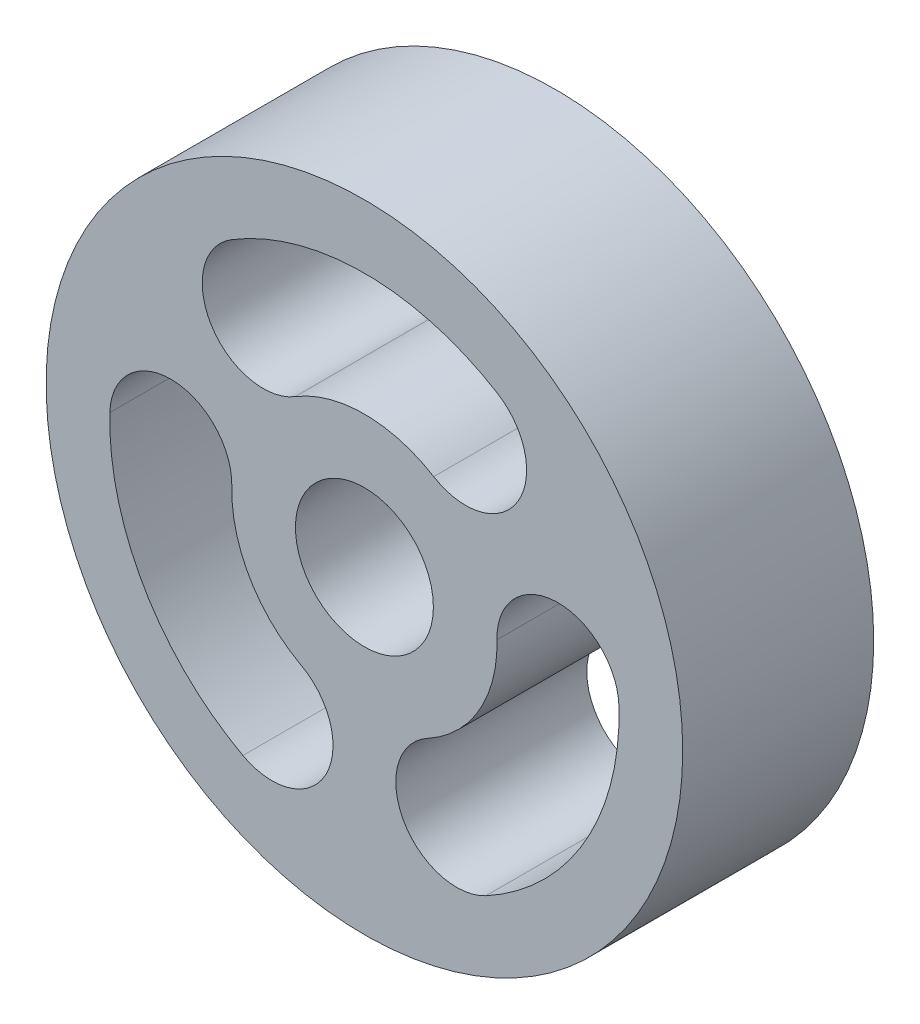
ISO-10303-21;
HEADER;
FILE_DESCRIPTION(('STEP AP214'),'2;1');
FILE_NAME('part.step','',(''),(''),'','','');
FILE_SCHEMA(('AUTOMOTIVE_DESIGN { 1 0 10303 214 1 1 1 1 }'));
ENDSEC;
DATA;
#1=APPLICATION_CONTEXT('core data for automotive mechanical design processes');
#2=APPLICATION_PROTOCOL_DEFINITION('international standard','automotive_design',2000,#1);
#3=PRODUCT_CONTEXT('',#1,'mechanical');
#4=PRODUCT('Part','Part','',(#3));
#5=PRODUCT_RELATED_PRODUCT_CATEGORY('part','',(#4));
#6=PRODUCT_DEFINITION_FORMATION('','',#4);
#7=PRODUCT_DEFINITION_CONTEXT('part definition',#1,'design');
#8=PRODUCT_DEFINITION('design','',#6,#7);
#9=PRODUCT_DEFINITION_SHAPE('','',#8);
#10=(LENGTH_UNIT() NAMED_UNIT(*) SI_UNIT(.MILLI.,.METRE.));
#11=(NAMED_UNIT(*) PLANE_ANGLE_UNIT() SI_UNIT($,.RADIAN.));
#12=(NAMED_UNIT(*) SI_UNIT($,.STERADIAN.) SOLID_ANGLE_UNIT());
#13=UNCERTAINTY_MEASURE_WITH_UNIT(LENGTH_MEASURE(1.E-05),#10,'distance_accuracy_value','');
#14=(GEOMETRIC_REPRESENTATION_CONTEXT(3) GLOBAL_UNCERTAINTY_ASSIGNED_CONTEXT((#13)) GLOBAL_UNIT_ASSIGNED_CONTEXT((#10,
#11,#12)) REPRESENTATION_CONTEXT('',''));
#15=CARTESIAN_POINT('',(0.,0.,0.));
#16=DIRECTION('',(0.,0.,1.));
#17=DIRECTION('',(1.,0.,0.));
#18=AXIS2_PLACEMENT_3D('',#15,#16,#17);
#19=CARTESIAN_POINT('',(0.,0.,9.));
#20=DIRECTION('',(0.,0.,1.));
#21=DIRECTION('',(1.,0.,0.));
#22=AXIS2_PLACEMENT_3D('',#19,#20,#21);
#23=PLANE('',#22);
#24=CARTESIAN_POINT('',(0.,0.,9.));
#25=DIRECTION('',(0.,0.,1.));
#26=DIRECTION('',(1.,0.,0.));
#27=AXIS2_PLACEMENT_3D('',#24,#25,#26);
#28=CIRCLE('',#27,15.);
#29=CARTESIAN_POINT('',(15.,0.,9.));
#30=VERTEX_POINT('',#29);
#31=EDGE_CURVE('E11',#30,#30,#28,.T.);
#32=ORIENTED_EDGE('',*,*,#31,.T.);
#33=EDGE_LOOP('',(#32));
#34=FACE_BOUND('',#33,.T.);
#35=CARTESIAN_POINT('',(0.,0.,9.));
#36=DIRECTION('',(0.,0.,1.));
#37=DIRECTION('',(1.,0.,0.));
#38=AXIS2_PLACEMENT_3D('',#35,#36,#37);
#39=CIRCLE('',#38,3.25);
#40=CARTESIAN_POINT('',(3.25,0.,9.));
#41=VERTEX_POINT('',#40);
#42=EDGE_CURVE('E222',#41,#41,#39,.T.);
#43=ORIENTED_EDGE('',*,*,#42,.F.);
#44=EDGE_LOOP('',(#43));
#45=FACE_BOUND('',#44,.T.);
#46=CARTESIAN_POINT('',(0.,0.,9.));
#47=DIRECTION('',(0.,0.,1.));
#48=DIRECTION('',(1.,0.,0.));
#49=AXIS2_PLACEMENT_3D('',#46,#47,#48);
#50=CIRCLE('',#49,12.);
#51=CARTESIAN_POINT('',(6.26998277659137,10.2316819722491,9.));
#52=VERTEX_POINT('',#51);
#53=CARTESIAN_POINT('',(-6.26998277659136,10.2316819722491,9.));
#54=VERTEX_POINT('',#53);
#55=EDGE_CURVE('E193',#52,#54,#50,.T.);
#56=ORIENTED_EDGE('',*,*,#55,.F.);
#57=CARTESIAN_POINT('',(4.76779940303302,7.7803414997311,9.));
#58=DIRECTION('',(0.,0.,1.));
#59=DIRECTION('',(1.,0.,0.));
#60=AXIS2_PLACEMENT_3D('',#57,#58,#59);
#61=CIRCLE('',#60,2.875);
#62=CARTESIAN_POINT('',(3.26561602947467,5.32900102721308,9.));
#63=VERTEX_POINT('',#62);
#64=EDGE_CURVE('E191',#63,#52,#61,.T.);
#65=ORIENTED_EDGE('',*,*,#64,.F.);
#66=CARTESIAN_POINT('',(0.,0.,9.));
#67=DIRECTION('',(0.,0.,-1.));
#68=DIRECTION('',(1.,0.,0.));
#69=AXIS2_PLACEMENT_3D('',#66,#67,#68);
#70=CIRCLE('',#69,6.25);
#71=CARTESIAN_POINT('',(-3.26561602947467,5.32900102721308,9.));
#72=VERTEX_POINT('',#71);
#73=EDGE_CURVE('E199',#72,#63,#70,.T.);
#74=ORIENTED_EDGE('',*,*,#73,.F.);
#75=CARTESIAN_POINT('',(-4.76779940303302,7.7803414997311,9.));
#76=DIRECTION('',(0.,0.,1.));
#77=DIRECTION('',(1.,0.,0.));
#78=AXIS2_PLACEMENT_3D('',#75,#76,#77);
#79=CIRCLE('',#78,2.875);
#80=EDGE_CURVE('E196',#54,#72,#79,.T.);
#81=ORIENTED_EDGE('',*,*,#80,.F.);
#82=EDGE_LOOP('',(#56,#65,#74,#81));
#83=FACE_BOUND('',#82,.T.);
#84=CARTESIAN_POINT('',(0.,0.,9.));
#85=DIRECTION('',(0.,0.,1.));
#86=DIRECTION('',(1.,0.,0.));
#87=AXIS2_PLACEMENT_3D('',#84,#85,#86);
#88=CIRCLE('',#87,12.);
#89=CARTESIAN_POINT('',(5.72590512311533,-10.5458053519436,9.));
#90=VERTEX_POINT('',#89);
#91=CARTESIAN_POINT('',(11.9958878997067,0.314123379694448,9.));
#92=VERTEX_POINT('',#91);
#93=EDGE_CURVE('E162',#90,#92,#88,.T.);
#94=ORIENTED_EDGE('',*,*,#93,.F.);
#95=CARTESIAN_POINT('',(4.35407368736895,-8.01920615304042,9.));
#96=DIRECTION('',(0.,0.,1.));
#97=DIRECTION('',(1.,0.,0.));
#98=AXIS2_PLACEMENT_3D('',#95,#96,#97);
#99=CIRCLE('',#98,2.875);
#100=CARTESIAN_POINT('',(2.98224225162257,-5.49260695413728,9.));
#101=VERTEX_POINT('',#100);
#102=EDGE_CURVE('E160',#101,#90,#99,.T.);
#103=ORIENTED_EDGE('',*,*,#102,.F.);
#104=CARTESIAN_POINT('',(0.,0.,9.));
#105=DIRECTION('',(0.,0.,-1.));
#106=DIRECTION('',(1.,0.,0.));
#107=AXIS2_PLACEMENT_3D('',#104,#105,#106);
#108=CIRCLE('',#107,6.25);
#109=CARTESIAN_POINT('',(6.24785828109723,0.163605926924194,9.));
#110=VERTEX_POINT('',#109);
#111=EDGE_CURVE('E168',#110,#101,#108,.T.);
#112=ORIENTED_EDGE('',*,*,#111,.F.);
#113=CARTESIAN_POINT('',(9.12187309040196,0.238864653309323,9.));
#114=DIRECTION('',(0.,0.,1.));
#115=DIRECTION('',(1.,0.,0.));
#116=AXIS2_PLACEMENT_3D('',#113,#114,#115);
#117=CIRCLE('',#116,2.875);
#118=EDGE_CURVE('E165',#92,#110,#117,.T.);
#119=ORIENTED_EDGE('',*,*,#118,.F.);
#120=EDGE_LOOP('',(#94,#103,#112,#119));
#121=FACE_BOUND('',#120,.T.);
#122=CARTESIAN_POINT('',(0.,0.,9.));
#123=DIRECTION('',(0.,0.,1.));
#124=DIRECTION('',(1.,0.,0.));
#125=AXIS2_PLACEMENT_3D('',#122,#123,#124);
#126=CIRCLE('',#125,12.);
#127=CARTESIAN_POINT('',(-11.9958878997067,0.314123379694449,9.));
#128=VERTEX_POINT('',#127);
#129=CARTESIAN_POINT('',(-5.72590512311533,-10.5458053519436,9.));
#130=VERTEX_POINT('',#129);
#131=EDGE_CURVE('E132',#128,#130,#126,.T.);
#132=ORIENTED_EDGE('',*,*,#131,.F.);
#133=CARTESIAN_POINT('',(-9.12187309040196,0.238864653309319,9.));
#134=DIRECTION('',(0.,0.,1.));
#135=DIRECTION('',(1.,0.,0.));
#136=AXIS2_PLACEMENT_3D('',#133,#134,#135);
#137=CIRCLE('',#136,2.875);
#138=CARTESIAN_POINT('',(-6.24785828109723,0.163605926924192,9.));
#139=VERTEX_POINT('',#138);
#140=EDGE_CURVE('E124',#139,#128,#137,.T.);
#141=ORIENTED_EDGE('',*,*,#140,.F.);
#142=CARTESIAN_POINT('',(0.,0.,9.));
#143=DIRECTION('',(0.,0.,-1.));
#144=DIRECTION('',(1.,0.,0.));
#145=AXIS2_PLACEMENT_3D('',#142,#143,#144);
#146=CIRCLE('',#145,6.25);
#147=CARTESIAN_POINT('',(-2.98224225162256,-5.49260695413728,9.));
#148=VERTEX_POINT('',#147);
#149=EDGE_CURVE('E146',#148,#139,#146,.T.);
#150=ORIENTED_EDGE('',*,*,#149,.F.);
#151=CARTESIAN_POINT('',(-4.35407368736895,-8.01920615304042,9.));
#152=DIRECTION('',(0.,0.,1.));
#153=DIRECTION('',(1.,0.,0.));
#154=AXIS2_PLACEMENT_3D('',#151,#152,#153);
#155=CIRCLE('',#154,2.875);
#156=EDGE_CURVE('E144',#130,#148,#155,.T.);
#157=ORIENTED_EDGE('',*,*,#156,.F.);
#158=EDGE_LOOP('',(#132,#141,#150,#157));
#159=FACE_BOUND('',#158,.T.);
#160=ADVANCED_FACE('F35',(#34,#45,#83,#121,#159),#23,.T.);
#161=CARTESIAN_POINT('',(0.,0.,0.));
#162=DIRECTION('',(0.,0.,1.));
#163=DIRECTION('',(1.,0.,0.));
#164=AXIS2_PLACEMENT_3D('',#161,#162,#163);
#165=PLANE('',#164);
#166=CARTESIAN_POINT('',(4.35407368736895,-8.01920615304042,0.));
#167=DIRECTION('',(0.,0.,1.));
#168=DIRECTION('',(1.,0.,0.));
#169=AXIS2_PLACEMENT_3D('',#166,#167,#168);
#170=CIRCLE('',#169,2.875);
#171=CARTESIAN_POINT('',(2.98224225162257,-5.49260695413728,0.));
#172=VERTEX_POINT('',#171);
#173=CARTESIAN_POINT('',(5.72590512311533,-10.5458053519436,0.));
#174=VERTEX_POINT('',#173);
#175=EDGE_CURVE('E140',#172,#174,#170,.T.);
#176=ORIENTED_EDGE('',*,*,#175,.T.);
#177=CARTESIAN_POINT('',(0.,0.,0.));
#178=DIRECTION('',(0.,0.,1.));
#179=DIRECTION('',(1.,0.,0.));
#180=AXIS2_PLACEMENT_3D('',#177,#178,#179);
#181=CIRCLE('',#180,12.);
#182=CARTESIAN_POINT('',(11.9958878997067,0.314123379694448,0.));
#183=VERTEX_POINT('',#182);
#184=EDGE_CURVE('E173',#174,#183,#181,.T.);
#185=ORIENTED_EDGE('',*,*,#184,.T.);
#186=CARTESIAN_POINT('',(9.12187309040196,0.238864653309323,0.));
#187=DIRECTION('',(0.,0.,1.));
#188=DIRECTION('',(1.,0.,0.));
#189=AXIS2_PLACEMENT_3D('',#186,#187,#188);
#190=CIRCLE('',#189,2.875);
#191=CARTESIAN_POINT('',(6.24785828109723,0.163605926924194,0.));
#192=VERTEX_POINT('',#191);
#193=EDGE_CURVE('E176',#183,#192,#190,.T.);
#194=ORIENTED_EDGE('',*,*,#193,.T.);
#195=CARTESIAN_POINT('',(0.,0.,0.));
#196=DIRECTION('',(0.,0.,-1.));
#197=DIRECTION('',(1.,0.,0.));
#198=AXIS2_PLACEMENT_3D('',#195,#196,#197);
#199=CIRCLE('',#198,6.25);
#200=EDGE_CURVE('E163',#192,#172,#199,.T.);
#201=ORIENTED_EDGE('',*,*,#200,.T.);
#202=EDGE_LOOP('',(#176,#185,#194,#201));
#203=FACE_BOUND('',#202,.T.);
#204=CARTESIAN_POINT('',(0.,0.,0.));
#205=DIRECTION('',(0.,0.,1.));
#206=DIRECTION('',(1.,0.,0.));
#207=AXIS2_PLACEMENT_3D('',#204,#205,#206);
#208=CIRCLE('',#207,3.25);
#209=CARTESIAN_POINT('',(3.25,0.,0.));
#210=VERTEX_POINT('',#209);
#211=EDGE_CURVE('E221',#210,#210,#208,.T.);
#212=ORIENTED_EDGE('',*,*,#211,.T.);
#213=EDGE_LOOP('',(#212));
#214=FACE_BOUND('',#213,.T.);
#215=CARTESIAN_POINT('',(0.,0.,0.));
#216=DIRECTION('',(0.,0.,1.));
#217=DIRECTION('',(1.,0.,0.));
#218=AXIS2_PLACEMENT_3D('',#215,#216,#217);
#219=CIRCLE('',#218,15.);
#220=CARTESIAN_POINT('',(15.,0.,0.));
#221=VERTEX_POINT('',#220);
#222=EDGE_CURVE('E39',#221,#221,#219,.T.);
#223=ORIENTED_EDGE('',*,*,#222,.F.);
#224=EDGE_LOOP('',(#223));
#225=FACE_BOUND('',#224,.T.);
#226=CARTESIAN_POINT('',(4.76779940303302,7.7803414997311,0.));
#227=DIRECTION('',(0.,0.,1.));
#228=DIRECTION('',(1.,0.,0.));
#229=AXIS2_PLACEMENT_3D('',#226,#227,#228);
#230=CIRCLE('',#229,2.875);
#231=CARTESIAN_POINT('',(3.26561602947467,5.32900102721308,0.));
#232=VERTEX_POINT('',#231);
#233=CARTESIAN_POINT('',(6.26998277659137,10.2316819722491,0.));
#234=VERTEX_POINT('',#233);
#235=EDGE_CURVE('E190',#232,#234,#230,.T.);
#236=ORIENTED_EDGE('',*,*,#235,.T.);
#237=CARTESIAN_POINT('',(0.,0.,0.));
#238=DIRECTION('',(0.,0.,1.));
#239=DIRECTION('',(1.,0.,0.));
#240=AXIS2_PLACEMENT_3D('',#237,#238,#239);
#241=CIRCLE('',#240,12.);
#242=CARTESIAN_POINT('',(-6.26998277659136,10.2316819722491,0.));
#243=VERTEX_POINT('',#242);
#244=EDGE_CURVE('E204',#234,#243,#241,.T.);
#245=ORIENTED_EDGE('',*,*,#244,.T.);
#246=CARTESIAN_POINT('',(-4.76779940303302,7.7803414997311,0.));
#247=DIRECTION('',(0.,0.,1.));
#248=DIRECTION('',(1.,0.,0.));
#249=AXIS2_PLACEMENT_3D('',#246,#247,#248);
#250=CIRCLE('',#249,2.875);
#251=CARTESIAN_POINT('',(-3.26561602947467,5.32900102721308,0.));
#252=VERTEX_POINT('',#251);
#253=EDGE_CURVE('E207',#243,#252,#250,.T.);
#254=ORIENTED_EDGE('',*,*,#253,.T.);
#255=CARTESIAN_POINT('',(0.,0.,0.));
#256=DIRECTION('',(0.,0.,-1.));
#257=DIRECTION('',(1.,0.,0.));
#258=AXIS2_PLACEMENT_3D('',#255,#256,#257);
#259=CIRCLE('',#258,6.25);
#260=EDGE_CURVE('E194',#252,#232,#259,.T.);
#261=ORIENTED_EDGE('',*,*,#260,.T.);
#262=EDGE_LOOP('',(#236,#245,#254,#261));
#263=FACE_BOUND('',#262,.T.);
#264=CARTESIAN_POINT('',(-9.12187309040196,0.238864653309319,0.));
#265=DIRECTION('',(0.,0.,1.));
#266=DIRECTION('',(1.,0.,0.));
#267=AXIS2_PLACEMENT_3D('',#264,#265,#266);
#268=CIRCLE('',#267,2.875);
#269=CARTESIAN_POINT('',(-6.24785828109723,0.163605926924192,0.));
#270=VERTEX_POINT('',#269);
#271=CARTESIAN_POINT('',(-11.9958878997067,0.314123379694449,0.));
#272=VERTEX_POINT('',#271);
#273=EDGE_CURVE('E58',#270,#272,#268,.T.);
#274=ORIENTED_EDGE('',*,*,#273,.T.);
#275=CARTESIAN_POINT('',(0.,0.,0.));
#276=DIRECTION('',(0.,0.,1.));
#277=DIRECTION('',(1.,0.,0.));
#278=AXIS2_PLACEMENT_3D('',#275,#276,#277);
#279=CIRCLE('',#278,12.);
#280=CARTESIAN_POINT('',(-5.72590512311533,-10.5458053519436,0.));
#281=VERTEX_POINT('',#280);
#282=EDGE_CURVE('E139',#272,#281,#279,.T.);
#283=ORIENTED_EDGE('',*,*,#282,.T.);
#284=CARTESIAN_POINT('',(-4.35407368736895,-8.01920615304042,0.));
#285=DIRECTION('',(0.,0.,1.));
#286=DIRECTION('',(1.,0.,0.));
#287=AXIS2_PLACEMENT_3D('',#284,#285,#286);
#288=CIRCLE('',#287,2.875);
#289=CARTESIAN_POINT('',(-2.98224225162256,-5.49260695413728,0.));
#290=VERTEX_POINT('',#289);
#291=EDGE_CURVE('E152',#281,#290,#288,.T.);
#292=ORIENTED_EDGE('',*,*,#291,.T.);
#293=CARTESIAN_POINT('',(0.,0.,0.));
#294=DIRECTION('',(0.,0.,-1.));
#295=DIRECTION('',(1.,0.,0.));
#296=AXIS2_PLACEMENT_3D('',#293,#294,#295);
#297=CIRCLE('',#296,6.25);
#298=EDGE_CURVE('E133',#290,#270,#297,.T.);
#299=ORIENTED_EDGE('',*,*,#298,.T.);
#300=EDGE_LOOP('',(#274,#283,#292,#299));
#301=FACE_BOUND('',#300,.T.);
#302=ADVANCED_FACE('F228',(#203,#214,#225,#263,#301),#165,.F.);
#303=CARTESIAN_POINT('',(0.,0.,9.));
#304=DIRECTION('',(0.,0.,-1.));
#305=DIRECTION('',(-1.,0.,0.));
#306=AXIS2_PLACEMENT_3D('',#303,#304,#305);
#307=CYLINDRICAL_SURFACE('',#306,15.);
#308=ORIENTED_EDGE('',*,*,#31,.F.);
#309=EDGE_LOOP('',(#308));
#310=FACE_BOUND('',#309,.T.);
#311=ORIENTED_EDGE('',*,*,#222,.T.);
#312=EDGE_LOOP('',(#311));
#313=FACE_BOUND('',#312,.T.);
#314=ADVANCED_FACE('F37',(#310,#313),#307,.T.);
#315=CARTESIAN_POINT('',(0.,0.,9.));
#316=DIRECTION('',(0.,0.,-1.));
#317=DIRECTION('',(-1.,0.,0.));
#318=AXIS2_PLACEMENT_3D('',#315,#316,#317);
#319=CYLINDRICAL_SURFACE('',#318,3.25);
#320=ORIENTED_EDGE('',*,*,#42,.T.);
#321=EDGE_LOOP('',(#320));
#322=FACE_BOUND('',#321,.T.);
#323=ORIENTED_EDGE('',*,*,#211,.F.);
#324=EDGE_LOOP('',(#323));
#325=FACE_BOUND('',#324,.T.);
#326=ADVANCED_FACE('F231',(#322,#325),#319,.F.);
#327=CARTESIAN_POINT('',(4.76779940303302,7.7803414997311,9.));
#328=DIRECTION('',(0.,0.,-1.));
#329=DIRECTION('',(-1.,0.,0.));
#330=AXIS2_PLACEMENT_3D('',#327,#328,#329);
#331=CYLINDRICAL_SURFACE('',#330,2.875);
#332=ORIENTED_EDGE('',*,*,#235,.F.);
#333=DIRECTION('',(0.,0.,-1.));
#334=VECTOR('',#333,1.);
#335=CARTESIAN_POINT('',(3.26561602947467,5.32900102721308,9.));
#336=LINE('',#335,#334);
#337=EDGE_CURVE('E201',#63,#232,#336,.T.);
#338=ORIENTED_EDGE('',*,*,#337,.F.);
#339=ORIENTED_EDGE('',*,*,#64,.T.);
#340=DIRECTION('',(0.,0.,-1.));
#341=VECTOR('',#340,1.);
#342=CARTESIAN_POINT('',(6.26998277659137,10.2316819722491,9.));
#343=LINE('',#342,#341);
#344=EDGE_CURVE('E218',#52,#234,#343,.T.);
#345=ORIENTED_EDGE('',*,*,#344,.T.);
#346=EDGE_LOOP('',(#332,#338,#339,#345));
#347=FACE_BOUND('',#346,.T.);
#348=ADVANCED_FACE('F233',(#347),#331,.F.);
#349=CARTESIAN_POINT('',(0.,0.,9.));
#350=DIRECTION('',(0.,0.,-1.));
#351=DIRECTION('',(-1.,0.,0.));
#352=AXIS2_PLACEMENT_3D('',#349,#350,#351);
#353=CYLINDRICAL_SURFACE('',#352,12.);
#354=ORIENTED_EDGE('',*,*,#244,.F.);
#355=ORIENTED_EDGE('',*,*,#344,.F.);
#356=ORIENTED_EDGE('',*,*,#55,.T.);
#357=DIRECTION('',(0.,0.,-1.));
#358=VECTOR('',#357,1.);
#359=CARTESIAN_POINT('',(-6.26998277659136,10.2316819722491,9.));
#360=LINE('',#359,#358);
#361=EDGE_CURVE('E216',#54,#243,#360,.T.);
#362=ORIENTED_EDGE('',*,*,#361,.T.);
#363=EDGE_LOOP('',(#354,#355,#356,#362));
#364=FACE_BOUND('',#363,.T.);
#365=ADVANCED_FACE('F240',(#364),#353,.F.);
#366=CARTESIAN_POINT('',(-4.76779940303302,7.7803414997311,9.));
#367=DIRECTION('',(0.,0.,-1.));
#368=DIRECTION('',(-1.,0.,0.));
#369=AXIS2_PLACEMENT_3D('',#366,#367,#368);
#370=CYLINDRICAL_SURFACE('',#369,2.875);
#371=ORIENTED_EDGE('',*,*,#253,.F.);
#372=ORIENTED_EDGE('',*,*,#361,.F.);
#373=ORIENTED_EDGE('',*,*,#80,.T.);
#374=DIRECTION('',(0.,0.,-1.));
#375=VECTOR('',#374,1.);
#376=CARTESIAN_POINT('',(-3.26561602947467,5.32900102721308,9.));
#377=LINE('',#376,#375);
#378=EDGE_CURVE('E214',#72,#252,#377,.T.);
#379=ORIENTED_EDGE('',*,*,#378,.T.);
#380=EDGE_LOOP('',(#371,#372,#373,#379));
#381=FACE_BOUND('',#380,.T.);
#382=ADVANCED_FACE('F293',(#381),#370,.F.);
#383=CARTESIAN_POINT('',(0.,0.,9.));
#384=DIRECTION('',(0.,0.,-1.));
#385=DIRECTION('',(-1.,0.,0.));
#386=AXIS2_PLACEMENT_3D('',#383,#384,#385);
#387=CYLINDRICAL_SURFACE('',#386,6.25);
#388=ORIENTED_EDGE('',*,*,#260,.F.);
#389=ORIENTED_EDGE('',*,*,#378,.F.);
#390=ORIENTED_EDGE('',*,*,#73,.T.);
#391=ORIENTED_EDGE('',*,*,#337,.T.);
#392=EDGE_LOOP('',(#388,#389,#390,#391));
#393=FACE_BOUND('',#392,.T.);
#394=ADVANCED_FACE('F290',(#393),#387,.T.);
#395=CARTESIAN_POINT('',(4.35407368736895,-8.01920615304042,9.));
#396=DIRECTION('',(0.,0.,-1.));
#397=DIRECTION('',(-1.,0.,0.));
#398=AXIS2_PLACEMENT_3D('',#395,#396,#397);
#399=CYLINDRICAL_SURFACE('',#398,2.875);
#400=ORIENTED_EDGE('',*,*,#175,.F.);
#401=DIRECTION('',(0.,0.,-1.));
#402=VECTOR('',#401,1.);
#403=CARTESIAN_POINT('',(2.98224225162257,-5.49260695413728,9.));
#404=LINE('',#403,#402);
#405=EDGE_CURVE('E170',#101,#172,#404,.T.);
#406=ORIENTED_EDGE('',*,*,#405,.F.);
#407=ORIENTED_EDGE('',*,*,#102,.T.);
#408=DIRECTION('',(0.,0.,-1.));
#409=VECTOR('',#408,1.);
#410=CARTESIAN_POINT('',(5.72590512311533,-10.5458053519436,9.));
#411=LINE('',#410,#409);
#412=EDGE_CURVE('E187',#90,#174,#411,.T.);
#413=ORIENTED_EDGE('',*,*,#412,.T.);
#414=EDGE_LOOP('',(#400,#406,#407,#413));
#415=FACE_BOUND('',#414,.T.);
#416=ADVANCED_FACE('F272',(#415),#399,.F.);
#417=CARTESIAN_POINT('',(0.,0.,9.));
#418=DIRECTION('',(0.,0.,-1.));
#419=DIRECTION('',(-1.,0.,0.));
#420=AXIS2_PLACEMENT_3D('',#417,#418,#419);
#421=CYLINDRICAL_SURFACE('',#420,12.);
#422=ORIENTED_EDGE('',*,*,#184,.F.);
#423=ORIENTED_EDGE('',*,*,#412,.F.);
#424=ORIENTED_EDGE('',*,*,#93,.T.);
#425=DIRECTION('',(0.,0.,-1.));
#426=VECTOR('',#425,1.);
#427=CARTESIAN_POINT('',(11.9958878997067,0.314123379694448,9.));
#428=LINE('',#427,#426);
#429=EDGE_CURVE('E185',#92,#183,#428,.T.);
#430=ORIENTED_EDGE('',*,*,#429,.T.);
#431=EDGE_LOOP('',(#422,#423,#424,#430));
#432=FACE_BOUND('',#431,.T.);
#433=ADVANCED_FACE('F266',(#432),#421,.F.);
#434=CARTESIAN_POINT('',(9.12187309040196,0.238864653309323,9.));
#435=DIRECTION('',(0.,0.,-1.));
#436=DIRECTION('',(-1.,0.,0.));
#437=AXIS2_PLACEMENT_3D('',#434,#435,#436);
#438=CYLINDRICAL_SURFACE('',#437,2.875);
#439=ORIENTED_EDGE('',*,*,#193,.F.);
#440=ORIENTED_EDGE('',*,*,#429,.F.);
#441=ORIENTED_EDGE('',*,*,#118,.T.);
#442=DIRECTION('',(0.,0.,-1.));
#443=VECTOR('',#442,1.);
#444=CARTESIAN_POINT('',(6.24785828109723,0.163605926924194,9.));
#445=LINE('',#444,#443);
#446=EDGE_CURVE('E183',#110,#192,#445,.T.);
#447=ORIENTED_EDGE('',*,*,#446,.T.);
#448=EDGE_LOOP('',(#439,#440,#441,#447));
#449=FACE_BOUND('',#448,.T.);
#450=ADVANCED_FACE('F269',(#449),#438,.F.);
#451=CARTESIAN_POINT('',(0.,0.,9.));
#452=DIRECTION('',(0.,0.,-1.));
#453=DIRECTION('',(-1.,0.,0.));
#454=AXIS2_PLACEMENT_3D('',#451,#452,#453);
#455=CYLINDRICAL_SURFACE('',#454,6.25);
#456=ORIENTED_EDGE('',*,*,#200,.F.);
#457=ORIENTED_EDGE('',*,*,#446,.F.);
#458=ORIENTED_EDGE('',*,*,#111,.T.);
#459=ORIENTED_EDGE('',*,*,#405,.T.);
#460=EDGE_LOOP('',(#456,#457,#458,#459));
#461=FACE_BOUND('',#460,.T.);
#462=ADVANCED_FACE('F275',(#461),#455,.T.);
#463=CARTESIAN_POINT('',(-9.12187309040196,0.238864653309319,9.));
#464=DIRECTION('',(0.,0.,-1.));
#465=DIRECTION('',(-1.,0.,0.));
#466=AXIS2_PLACEMENT_3D('',#463,#464,#465);
#467=CYLINDRICAL_SURFACE('',#466,2.875);
#468=ORIENTED_EDGE('',*,*,#273,.F.);
#469=DIRECTION('',(0.,0.,-1.));
#470=VECTOR('',#469,1.);
#471=CARTESIAN_POINT('',(-6.24785828109723,0.163605926924192,9.));
#472=LINE('',#471,#470);
#473=EDGE_CURVE('E128',#139,#270,#472,.T.);
#474=ORIENTED_EDGE('',*,*,#473,.F.);
#475=ORIENTED_EDGE('',*,*,#140,.T.);
#476=DIRECTION('',(0.,0.,-1.));
#477=VECTOR('',#476,1.);
#478=CARTESIAN_POINT('',(-11.9958878997067,0.314123379694449,9.));
#479=LINE('',#478,#477);
#480=EDGE_CURVE('E127',#128,#272,#479,.T.);
#481=ORIENTED_EDGE('',*,*,#480,.T.);
#482=EDGE_LOOP('',(#468,#474,#475,#481));
#483=FACE_BOUND('',#482,.T.);
#484=ADVANCED_FACE('F126',(#483),#467,.F.);
#485=CARTESIAN_POINT('',(0.,0.,9.));
#486=DIRECTION('',(0.,0.,-1.));
#487=DIRECTION('',(-1.,0.,0.));
#488=AXIS2_PLACEMENT_3D('',#485,#486,#487);
#489=CYLINDRICAL_SURFACE('',#488,12.);
#490=ORIENTED_EDGE('',*,*,#282,.F.);
#491=ORIENTED_EDGE('',*,*,#480,.F.);
#492=ORIENTED_EDGE('',*,*,#131,.T.);
#493=DIRECTION('',(0.,0.,-1.));
#494=VECTOR('',#493,1.);
#495=CARTESIAN_POINT('',(-5.72590512311533,-10.5458053519436,9.));
#496=LINE('',#495,#494);
#497=EDGE_CURVE('E141',#130,#281,#496,.T.);
#498=ORIENTED_EDGE('',*,*,#497,.T.);
#499=EDGE_LOOP('',(#490,#491,#492,#498));
#500=FACE_BOUND('',#499,.T.);
#501=ADVANCED_FACE('F136',(#500),#489,.F.);
#502=CARTESIAN_POINT('',(-4.35407368736895,-8.01920615304042,9.));
#503=DIRECTION('',(0.,0.,-1.));
#504=DIRECTION('',(-1.,0.,0.));
#505=AXIS2_PLACEMENT_3D('',#502,#503,#504);
#506=CYLINDRICAL_SURFACE('',#505,2.875);
#507=ORIENTED_EDGE('',*,*,#291,.F.);
#508=ORIENTED_EDGE('',*,*,#497,.F.);
#509=ORIENTED_EDGE('',*,*,#156,.T.);
#510=DIRECTION('',(0.,0.,-1.));
#511=VECTOR('',#510,1.);
#512=CARTESIAN_POINT('',(-2.98224225162256,-5.49260695413728,9.));
#513=LINE('',#512,#511);
#514=EDGE_CURVE('E50',#148,#290,#513,.T.);
#515=ORIENTED_EDGE('',*,*,#514,.T.);
#516=EDGE_LOOP('',(#507,#508,#509,#515));
#517=FACE_BOUND('',#516,.T.);
#518=ADVANCED_FACE('F313',(#517),#506,.F.);
#519=CARTESIAN_POINT('',(0.,0.,9.));
#520=DIRECTION('',(0.,0.,-1.));
#521=DIRECTION('',(-1.,0.,0.));
#522=AXIS2_PLACEMENT_3D('',#519,#520,#521);
#523=CYLINDRICAL_SURFACE('',#522,6.25);
#524=ORIENTED_EDGE('',*,*,#298,.F.);
#525=ORIENTED_EDGE('',*,*,#514,.F.);
#526=ORIENTED_EDGE('',*,*,#149,.T.);
#527=ORIENTED_EDGE('',*,*,#473,.T.);
#528=EDGE_LOOP('',(#524,#525,#526,#527));
#529=FACE_BOUND('',#528,.T.);
#530=ADVANCED_FACE('F311',(#529),#523,.T.);
#531=CLOSED_SHELL('',(#160,#302,#314,#326,#348,#365,#382,#394,#416,#433,#450,#462,#484,#501,
#518,#530));
#532=MANIFOLD_SOLID_BREP('B2',#531);
#533=ADVANCED_BREP_SHAPE_REPRESENTATION('',(#18,#532),#14);
#534=SHAPE_DEFINITION_REPRESENTATION(#9,#533);
ENDSEC;
END-ISO-10303-21;
